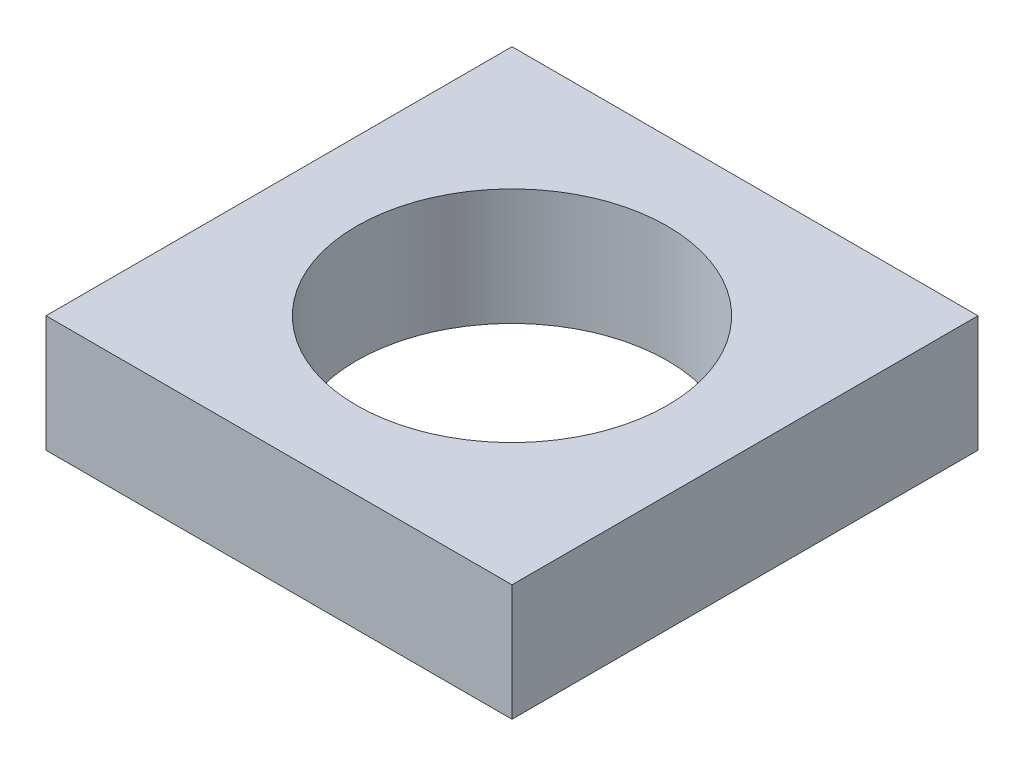
ISO-10303-21;
HEADER;
FILE_DESCRIPTION(('STEP AP214'),'2;1');
FILE_NAME('part.step','',(''),(''),'','','');
FILE_SCHEMA(('AUTOMOTIVE_DESIGN { 1 0 10303 214 1 1 1 1 }'));
ENDSEC;
DATA;
#1=APPLICATION_CONTEXT('core data for automotive mechanical design processes');
#2=APPLICATION_PROTOCOL_DEFINITION('international standard','automotive_design',2000,#1);
#3=PRODUCT_CONTEXT('',#1,'mechanical');
#4=PRODUCT('Part','Part','',(#3));
#5=PRODUCT_RELATED_PRODUCT_CATEGORY('part','',(#4));
#6=PRODUCT_DEFINITION_FORMATION('','',#4);
#7=PRODUCT_DEFINITION_CONTEXT('part definition',#1,'design');
#8=PRODUCT_DEFINITION('design','',#6,#7);
#9=PRODUCT_DEFINITION_SHAPE('','',#8);
#10=(LENGTH_UNIT() NAMED_UNIT(*) SI_UNIT(.MILLI.,.METRE.));
#11=(NAMED_UNIT(*) PLANE_ANGLE_UNIT() SI_UNIT($,.RADIAN.));
#12=(NAMED_UNIT(*) SI_UNIT($,.STERADIAN.) SOLID_ANGLE_UNIT());
#13=UNCERTAINTY_MEASURE_WITH_UNIT(LENGTH_MEASURE(1.E-05),#10,'distance_accuracy_value','');
#14=(GEOMETRIC_REPRESENTATION_CONTEXT(3) GLOBAL_UNCERTAINTY_ASSIGNED_CONTEXT((#13)) GLOBAL_UNIT_ASSIGNED_CONTEXT((#10,
#11,#12)) REPRESENTATION_CONTEXT('',''));
#15=CARTESIAN_POINT('',(0.,0.,0.));
#16=DIRECTION('',(0.,0.,1.));
#17=DIRECTION('',(1.,0.,0.));
#18=AXIS2_PLACEMENT_3D('',#15,#16,#17);
#19=CARTESIAN_POINT('',(0.,3.,0.));
#20=DIRECTION('',(0.,1.,0.));
#21=DIRECTION('',(0.,0.,1.));
#22=AXIS2_PLACEMENT_3D('',#19,#20,#21);
#23=PLANE('',#22);
#24=DIRECTION('',(0.,0.,-1.));
#25=VECTOR('',#24,1.);
#26=CARTESIAN_POINT('',(6.,3.,-6.));
#27=LINE('',#26,#25);
#28=CARTESIAN_POINT('',(6.,3.,6.));
#29=VERTEX_POINT('',#28);
#30=CARTESIAN_POINT('',(6.,3.,-6.));
#31=VERTEX_POINT('',#30);
#32=EDGE_CURVE('E92',#29,#31,#27,.T.);
#33=ORIENTED_EDGE('',*,*,#32,.T.);
#34=DIRECTION('',(-1.,0.,0.));
#35=VECTOR('',#34,1.);
#36=CARTESIAN_POINT('',(-6.,3.,-6.));
#37=LINE('',#36,#35);
#38=CARTESIAN_POINT('',(-6.,3.,-6.));
#39=VERTEX_POINT('',#38);
#40=EDGE_CURVE('E87',#31,#39,#37,.T.);
#41=ORIENTED_EDGE('',*,*,#40,.T.);
#42=DIRECTION('',(0.,0.,1.));
#43=VECTOR('',#42,1.);
#44=CARTESIAN_POINT('',(-6.,3.,-6.));
#45=LINE('',#44,#43);
#46=CARTESIAN_POINT('',(-6.,3.,6.));
#47=VERTEX_POINT('',#46);
#48=EDGE_CURVE('E90',#39,#47,#45,.T.);
#49=ORIENTED_EDGE('',*,*,#48,.T.);
#50=DIRECTION('',(1.,0.,0.));
#51=VECTOR('',#50,1.);
#52=CARTESIAN_POINT('',(-6.,3.,6.));
#53=LINE('',#52,#51);
#54=EDGE_CURVE('E57',#47,#29,#53,.T.);
#55=ORIENTED_EDGE('',*,*,#54,.T.);
#56=EDGE_LOOP('',(#33,#41,#49,#55));
#57=FACE_BOUND('',#56,.T.);
#58=CARTESIAN_POINT('',(0.,3.,0.));
#59=DIRECTION('',(0.,1.,0.));
#60=DIRECTION('',(0.,0.,1.));
#61=AXIS2_PLACEMENT_3D('',#58,#59,#60);
#62=CIRCLE('',#61,4.);
#63=CARTESIAN_POINT('',(0.,3.,4.));
#64=VERTEX_POINT('',#63);
#65=EDGE_CURVE('E112',#64,#64,#62,.T.);
#66=ORIENTED_EDGE('',*,*,#65,.F.);
#67=EDGE_LOOP('',(#66));
#68=FACE_BOUND('',#67,.T.);
#69=ADVANCED_FACE('F39',(#57,#68),#23,.T.);
#70=CARTESIAN_POINT('',(0.,0.,0.));
#71=DIRECTION('',(0.,1.,0.));
#72=DIRECTION('',(0.,0.,1.));
#73=AXIS2_PLACEMENT_3D('',#70,#71,#72);
#74=PLANE('',#73);
#75=DIRECTION('',(0.,0.,-1.));
#76=VECTOR('',#75,1.);
#77=CARTESIAN_POINT('',(6.,0.,-6.));
#78=LINE('',#77,#76);
#79=CARTESIAN_POINT('',(6.,0.,6.));
#80=VERTEX_POINT('',#79);
#81=CARTESIAN_POINT('',(6.,0.,-6.));
#82=VERTEX_POINT('',#81);
#83=EDGE_CURVE('E108',#80,#82,#78,.T.);
#84=ORIENTED_EDGE('',*,*,#83,.F.);
#85=DIRECTION('',(1.,0.,0.));
#86=VECTOR('',#85,1.);
#87=CARTESIAN_POINT('',(-6.,0.,6.));
#88=LINE('',#87,#86);
#89=CARTESIAN_POINT('',(-6.,0.,6.));
#90=VERTEX_POINT('',#89);
#91=EDGE_CURVE('E80',#90,#80,#88,.T.);
#92=ORIENTED_EDGE('',*,*,#91,.F.);
#93=DIRECTION('',(0.,0.,1.));
#94=VECTOR('',#93,1.);
#95=CARTESIAN_POINT('',(-6.,0.,-6.));
#96=LINE('',#95,#94);
#97=CARTESIAN_POINT('',(-6.,0.,-6.));
#98=VERTEX_POINT('',#97);
#99=EDGE_CURVE('E74',#98,#90,#96,.T.);
#100=ORIENTED_EDGE('',*,*,#99,.F.);
#101=DIRECTION('',(-1.,0.,0.));
#102=VECTOR('',#101,1.);
#103=CARTESIAN_POINT('',(-6.,0.,-6.));
#104=LINE('',#103,#102);
#105=EDGE_CURVE('E97',#82,#98,#104,.T.);
#106=ORIENTED_EDGE('',*,*,#105,.F.);
#107=EDGE_LOOP('',(#84,#92,#100,#106));
#108=FACE_BOUND('',#107,.T.);
#109=CARTESIAN_POINT('',(0.,0.,0.));
#110=DIRECTION('',(0.,1.,0.));
#111=DIRECTION('',(0.,0.,1.));
#112=AXIS2_PLACEMENT_3D('',#109,#110,#111);
#113=CIRCLE('',#112,4.);
#114=CARTESIAN_POINT('',(0.,0.,4.));
#115=VERTEX_POINT('',#114);
#116=EDGE_CURVE('E130',#115,#115,#113,.T.);
#117=ORIENTED_EDGE('',*,*,#116,.T.);
#118=EDGE_LOOP('',(#117));
#119=FACE_BOUND('',#118,.T.);
#120=ADVANCED_FACE('F125',(#108,#119),#74,.F.);
#121=CARTESIAN_POINT('',(6.,3.,-6.));
#122=DIRECTION('',(-1.,0.,0.));
#123=DIRECTION('',(0.,0.,1.));
#124=AXIS2_PLACEMENT_3D('',#121,#122,#123);
#125=PLANE('',#124);
#126=ORIENTED_EDGE('',*,*,#83,.T.);
#127=DIRECTION('',(0.,-1.,0.));
#128=VECTOR('',#127,1.);
#129=CARTESIAN_POINT('',(6.,3.,-6.));
#130=LINE('',#129,#128);
#131=EDGE_CURVE('E11',#31,#82,#130,.T.);
#132=ORIENTED_EDGE('',*,*,#131,.F.);
#133=ORIENTED_EDGE('',*,*,#32,.F.);
#134=DIRECTION('',(0.,-1.,0.));
#135=VECTOR('',#134,1.);
#136=CARTESIAN_POINT('',(6.,3.,6.));
#137=LINE('',#136,#135);
#138=EDGE_CURVE('E104',#29,#80,#137,.T.);
#139=ORIENTED_EDGE('',*,*,#138,.T.);
#140=EDGE_LOOP('',(#126,#132,#133,#139));
#141=FACE_BOUND('',#140,.T.);
#142=ADVANCED_FACE('F41',(#141),#125,.F.);
#143=CARTESIAN_POINT('',(-6.,3.,-6.));
#144=DIRECTION('',(0.,0.,1.));
#145=DIRECTION('',(1.,0.,0.));
#146=AXIS2_PLACEMENT_3D('',#143,#144,#145);
#147=PLANE('',#146);
#148=ORIENTED_EDGE('',*,*,#105,.T.);
#149=DIRECTION('',(0.,-1.,0.));
#150=VECTOR('',#149,1.);
#151=CARTESIAN_POINT('',(-6.,3.,-6.));
#152=LINE('',#151,#150);
#153=EDGE_CURVE('E49',#39,#98,#152,.T.);
#154=ORIENTED_EDGE('',*,*,#153,.F.);
#155=ORIENTED_EDGE('',*,*,#40,.F.);
#156=ORIENTED_EDGE('',*,*,#131,.T.);
#157=EDGE_LOOP('',(#148,#154,#155,#156));
#158=FACE_BOUND('',#157,.T.);
#159=ADVANCED_FACE('F96',(#158),#147,.F.);
#160=CARTESIAN_POINT('',(-6.,3.,-6.));
#161=DIRECTION('',(1.,0.,0.));
#162=DIRECTION('',(0.,0.,-1.));
#163=AXIS2_PLACEMENT_3D('',#160,#161,#162);
#164=PLANE('',#163);
#165=ORIENTED_EDGE('',*,*,#99,.T.);
#166=DIRECTION('',(0.,-1.,0.));
#167=VECTOR('',#166,1.);
#168=CARTESIAN_POINT('',(-6.,3.,6.));
#169=LINE('',#168,#167);
#170=EDGE_CURVE('E99',#47,#90,#169,.T.);
#171=ORIENTED_EDGE('',*,*,#170,.F.);
#172=ORIENTED_EDGE('',*,*,#48,.F.);
#173=ORIENTED_EDGE('',*,*,#153,.T.);
#174=EDGE_LOOP('',(#165,#171,#172,#173));
#175=FACE_BOUND('',#174,.T.);
#176=ADVANCED_FACE('F100',(#175),#164,.F.);
#177=CARTESIAN_POINT('',(-6.,3.,6.));
#178=DIRECTION('',(0.,0.,-1.));
#179=DIRECTION('',(-1.,0.,0.));
#180=AXIS2_PLACEMENT_3D('',#177,#178,#179);
#181=PLANE('',#180);
#182=ORIENTED_EDGE('',*,*,#91,.T.);
#183=ORIENTED_EDGE('',*,*,#138,.F.);
#184=ORIENTED_EDGE('',*,*,#54,.F.);
#185=ORIENTED_EDGE('',*,*,#170,.T.);
#186=EDGE_LOOP('',(#182,#183,#184,#185));
#187=FACE_BOUND('',#186,.T.);
#188=ADVANCED_FACE('F122',(#187),#181,.F.);
#189=CARTESIAN_POINT('',(0.,3.,0.));
#190=DIRECTION('',(0.,-1.,0.));
#191=DIRECTION('',(0.,0.,-1.));
#192=AXIS2_PLACEMENT_3D('',#189,#190,#191);
#193=CYLINDRICAL_SURFACE('',#192,4.);
#194=ORIENTED_EDGE('',*,*,#65,.T.);
#195=EDGE_LOOP('',(#194));
#196=FACE_BOUND('',#195,.T.);
#197=ORIENTED_EDGE('',*,*,#116,.F.);
#198=EDGE_LOOP('',(#197));
#199=FACE_BOUND('',#198,.T.);
#200=ADVANCED_FACE('F138',(#196,#199),#193,.F.);
#201=CLOSED_SHELL('',(#69,#120,#142,#159,#176,#188,#200));
#202=MANIFOLD_SOLID_BREP('B2',#201);
#203=ADVANCED_BREP_SHAPE_REPRESENTATION('',(#18,#202),#14);
#204=SHAPE_DEFINITION_REPRESENTATION(#9,#203);
ENDSEC;
END-ISO-10303-21;
